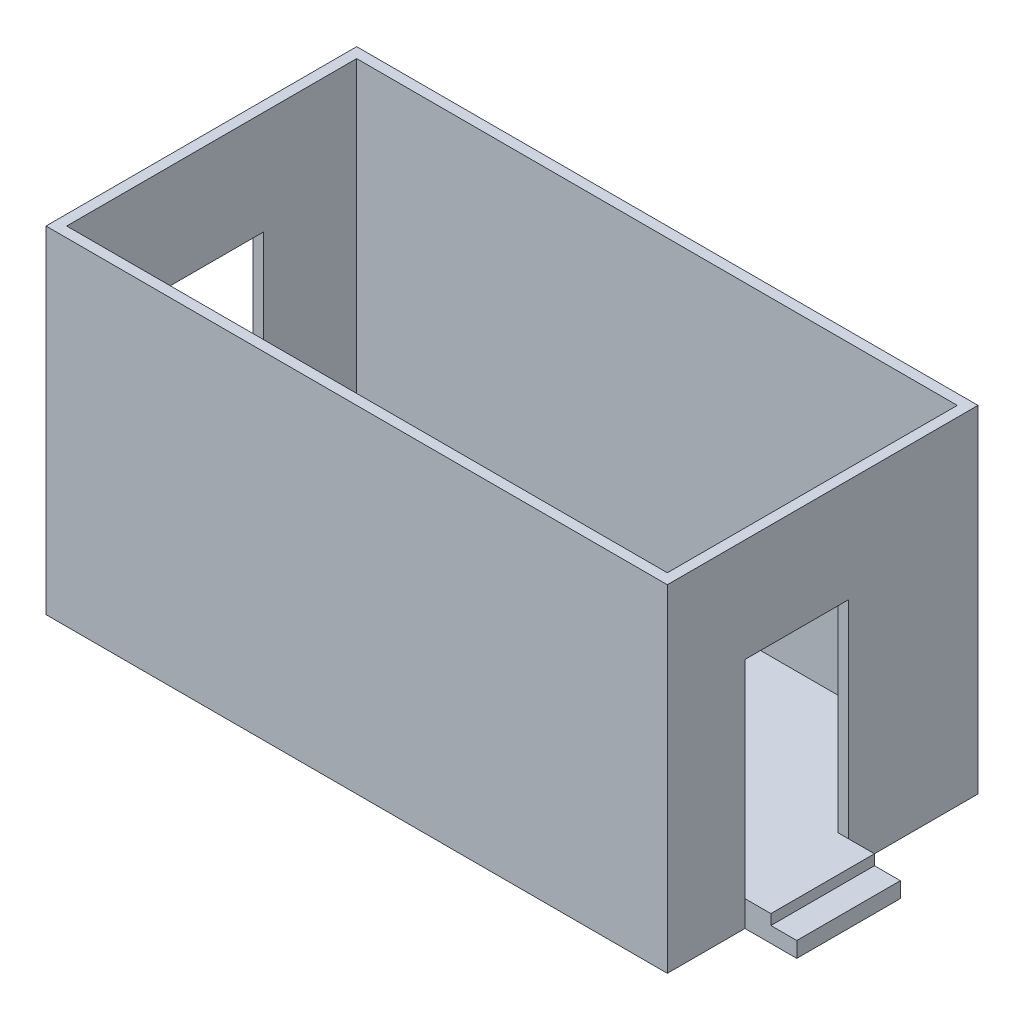
ISO-10303-21;
HEADER;
FILE_DESCRIPTION(('STEP AP214'),'2;1');
FILE_NAME('part.step','',(''),(''),'','','');
FILE_SCHEMA(('AUTOMOTIVE_DESIGN { 1 0 10303 214 1 1 1 1 }'));
ENDSEC;
DATA;
#1=APPLICATION_CONTEXT('core data for automotive mechanical design processes');
#2=APPLICATION_PROTOCOL_DEFINITION('international standard','automotive_design',2000,#1);
#3=PRODUCT_CONTEXT('',#1,'mechanical');
#4=PRODUCT('Part','Part','',(#3));
#5=PRODUCT_RELATED_PRODUCT_CATEGORY('part','',(#4));
#6=PRODUCT_DEFINITION_FORMATION('','',#4);
#7=PRODUCT_DEFINITION_CONTEXT('part definition',#1,'design');
#8=PRODUCT_DEFINITION('design','',#6,#7);
#9=PRODUCT_DEFINITION_SHAPE('','',#8);
#10=(LENGTH_UNIT() NAMED_UNIT(*) SI_UNIT(.MILLI.,.METRE.));
#11=(NAMED_UNIT(*) PLANE_ANGLE_UNIT() SI_UNIT($,.RADIAN.));
#12=(NAMED_UNIT(*) SI_UNIT($,.STERADIAN.) SOLID_ANGLE_UNIT());
#13=UNCERTAINTY_MEASURE_WITH_UNIT(LENGTH_MEASURE(1.E-05),#10,'distance_accuracy_value','');
#14=(GEOMETRIC_REPRESENTATION_CONTEXT(3) GLOBAL_UNCERTAINTY_ASSIGNED_CONTEXT((#13)) GLOBAL_UNIT_ASSIGNED_CONTEXT((#10,
#11,#12)) REPRESENTATION_CONTEXT('',''));
#15=CARTESIAN_POINT('',(0.,0.,0.));
#16=DIRECTION('',(0.,0.,1.));
#17=DIRECTION('',(1.,0.,0.));
#18=AXIS2_PLACEMENT_3D('',#15,#16,#17);
#19=CARTESIAN_POINT('',(-3500.,0.,0.));
#20=DIRECTION('',(-1.,0.,0.));
#21=DIRECTION('',(0.,0.,1.));
#22=AXIS2_PLACEMENT_3D('',#19,#20,#21);
#23=PLANE('',#22);
#24=DIRECTION('',(0.,1.,0.));
#25=VECTOR('',#24,1.);
#26=CARTESIAN_POINT('',(-3500.,250.,500.000000000001));
#27=LINE('',#26,#25);
#28=CARTESIAN_POINT('',(-3500.,0.,500.000000000001));
#29=VERTEX_POINT('',#28);
#30=CARTESIAN_POINT('',(-3500.,150.,500.000000000001));
#31=VERTEX_POINT('',#30);
#32=EDGE_CURVE('E224',#29,#31,#27,.T.);
#33=ORIENTED_EDGE('',*,*,#32,.T.);
#34=DIRECTION('',(0.,0.,1.));
#35=VECTOR('',#34,1.);
#36=CARTESIAN_POINT('',(-3500.,150.,-499.999999999999));
#37=LINE('',#36,#35);
#38=CARTESIAN_POINT('',(-3500.,150.,-499.999999999999));
#39=VERTEX_POINT('',#38);
#40=EDGE_CURVE('E209',#39,#31,#37,.T.);
#41=ORIENTED_EDGE('',*,*,#40,.F.);
#42=DIRECTION('',(0.,-1.,0.));
#43=VECTOR('',#42,1.);
#44=CARTESIAN_POINT('',(-3500.,250.,-499.999999999999));
#45=LINE('',#44,#43);
#46=CARTESIAN_POINT('',(-3500.,0.,-499.999999999999));
#47=VERTEX_POINT('',#46);
#48=EDGE_CURVE('E235',#39,#47,#45,.T.);
#49=ORIENTED_EDGE('',*,*,#48,.T.);
#50=DIRECTION('',(0.,0.,1.));
#51=VECTOR('',#50,1.);
#52=CARTESIAN_POINT('',(-3500.,0.,-499.999999999999));
#53=LINE('',#52,#51);
#54=EDGE_CURVE('E229',#47,#29,#53,.T.);
#55=ORIENTED_EDGE('',*,*,#54,.T.);
#56=EDGE_LOOP('',(#33,#41,#49,#55));
#57=FACE_BOUND('',#56,.T.);
#58=ADVANCED_FACE('F37',(#57),#23,.T.);
#59=CARTESIAN_POINT('',(-3000.,250.,-1500.));
#60=DIRECTION('',(1.,0.,0.));
#61=DIRECTION('',(0.,0.,-1.));
#62=AXIS2_PLACEMENT_3D('',#59,#60,#61);
#63=PLANE('',#62);
#64=DIRECTION('',(0.,-1.,0.));
#65=VECTOR('',#64,1.);
#66=CARTESIAN_POINT('',(-3000.,250.,-499.999999999999));
#67=LINE('',#66,#65);
#68=CARTESIAN_POINT('',(-3000.,250.,-499.999999999999));
#69=VERTEX_POINT('',#68);
#70=CARTESIAN_POINT('',(-3000.,0.,-499.999999999999));
#71=VERTEX_POINT('',#70);
#72=EDGE_CURVE('E239',#69,#71,#67,.T.);
#73=ORIENTED_EDGE('',*,*,#72,.F.);
#74=DIRECTION('',(0.,-1.,0.));
#75=VECTOR('',#74,1.);
#76=CARTESIAN_POINT('',(-3000.,2250.,-500.));
#77=LINE('',#76,#75);
#78=CARTESIAN_POINT('',(-3000.,2250.,-500.));
#79=VERTEX_POINT('',#78);
#80=EDGE_CURVE('E299',#79,#69,#77,.T.);
#81=ORIENTED_EDGE('',*,*,#80,.F.);
#82=DIRECTION('',(0.,0.,-1.));
#83=VECTOR('',#82,1.);
#84=CARTESIAN_POINT('',(-3000.,2250.,-500.));
#85=LINE('',#84,#83);
#86=CARTESIAN_POINT('',(-3000.,2250.,500.));
#87=VERTEX_POINT('',#86);
#88=EDGE_CURVE('E305',#87,#79,#85,.T.);
#89=ORIENTED_EDGE('',*,*,#88,.F.);
#90=DIRECTION('',(0.,1.,0.));
#91=VECTOR('',#90,1.);
#92=CARTESIAN_POINT('',(-3000.,2250.,500.));
#93=LINE('',#92,#91);
#94=CARTESIAN_POINT('',(-3000.,250.,500.000000000001));
#95=VERTEX_POINT('',#94);
#96=EDGE_CURVE('E302',#95,#87,#93,.T.);
#97=ORIENTED_EDGE('',*,*,#96,.F.);
#98=DIRECTION('',(0.,1.,0.));
#99=VECTOR('',#98,1.);
#100=CARTESIAN_POINT('',(-3000.,250.,500.000000000001));
#101=LINE('',#100,#99);
#102=CARTESIAN_POINT('',(-3000.,0.,500.));
#103=VERTEX_POINT('',#102);
#104=EDGE_CURVE('E242',#103,#95,#101,.T.);
#105=ORIENTED_EDGE('',*,*,#104,.F.);
#106=DIRECTION('',(0.,0.,1.));
#107=VECTOR('',#106,1.);
#108=CARTESIAN_POINT('',(-3000.,0.,-1500.));
#109=LINE('',#108,#107);
#110=CARTESIAN_POINT('',(-3000.,0.,1500.));
#111=VERTEX_POINT('',#110);
#112=EDGE_CURVE('E373',#103,#111,#109,.T.);
#113=ORIENTED_EDGE('',*,*,#112,.T.);
#114=DIRECTION('',(0.,-1.,0.));
#115=VECTOR('',#114,1.);
#116=CARTESIAN_POINT('',(-3000.,250.,1500.));
#117=LINE('',#116,#115);
#118=CARTESIAN_POINT('',(-3000.,3250.,1500.));
#119=VERTEX_POINT('',#118);
#120=EDGE_CURVE('E381',#119,#111,#117,.T.);
#121=ORIENTED_EDGE('',*,*,#120,.F.);
#122=DIRECTION('',(0.,0.,1.));
#123=VECTOR('',#122,1.);
#124=CARTESIAN_POINT('',(-3000.,3250.,-1500.));
#125=LINE('',#124,#123);
#126=CARTESIAN_POINT('',(-3000.,3250.,-1500.));
#127=VERTEX_POINT('',#126);
#128=EDGE_CURVE('E356',#127,#119,#125,.T.);
#129=ORIENTED_EDGE('',*,*,#128,.F.);
#130=DIRECTION('',(0.,-1.,0.));
#131=VECTOR('',#130,1.);
#132=CARTESIAN_POINT('',(-3000.,250.,-1500.));
#133=LINE('',#132,#131);
#134=CARTESIAN_POINT('',(-3000.,0.,-1500.));
#135=VERTEX_POINT('',#134);
#136=EDGE_CURVE('E384',#127,#135,#133,.T.);
#137=ORIENTED_EDGE('',*,*,#136,.T.);
#138=EDGE_CURVE('E374',#135,#71,#109,.T.);
#139=ORIENTED_EDGE('',*,*,#138,.T.);
#140=EDGE_LOOP('',(#73,#81,#89,#97,#105,#113,#121,#129,#137,#139));
#141=FACE_BOUND('',#140,.T.);
#142=ADVANCED_FACE('F453',(#141),#63,.F.);
#143=CARTESIAN_POINT('',(3000.,250.,-1500.));
#144=DIRECTION('',(-1.,0.,0.));
#145=DIRECTION('',(0.,0.,1.));
#146=AXIS2_PLACEMENT_3D('',#143,#144,#145);
#147=PLANE('',#146);
#148=DIRECTION('',(0.,-1.,0.));
#149=VECTOR('',#148,1.);
#150=CARTESIAN_POINT('',(3000.,250.,750.));
#151=LINE('',#150,#149);
#152=CARTESIAN_POINT('',(3000.,250.,750.));
#153=VERTEX_POINT('',#152);
#154=CARTESIAN_POINT('',(3000.,0.,750.));
#155=VERTEX_POINT('',#154);
#156=EDGE_CURVE('E252',#153,#155,#151,.T.);
#157=ORIENTED_EDGE('',*,*,#156,.F.);
#158=DIRECTION('',(0.,-1.,0.));
#159=VECTOR('',#158,1.);
#160=CARTESIAN_POINT('',(3000.,2250.,750.));
#161=LINE('',#160,#159);
#162=CARTESIAN_POINT('',(3000.,2250.,750.));
#163=VERTEX_POINT('',#162);
#164=EDGE_CURVE('E275',#163,#153,#161,.T.);
#165=ORIENTED_EDGE('',*,*,#164,.F.);
#166=DIRECTION('',(0.,0.,1.));
#167=VECTOR('',#166,1.);
#168=CARTESIAN_POINT('',(3000.,2250.,750.));
#169=LINE('',#168,#167);
#170=CARTESIAN_POINT('',(3000.,2250.,-250.));
#171=VERTEX_POINT('',#170);
#172=EDGE_CURVE('E281',#171,#163,#169,.T.);
#173=ORIENTED_EDGE('',*,*,#172,.F.);
#174=DIRECTION('',(0.,1.,0.));
#175=VECTOR('',#174,1.);
#176=CARTESIAN_POINT('',(3000.,2250.,-250.));
#177=LINE('',#176,#175);
#178=CARTESIAN_POINT('',(3000.,250.,-250.));
#179=VERTEX_POINT('',#178);
#180=EDGE_CURVE('E278',#179,#171,#177,.T.);
#181=ORIENTED_EDGE('',*,*,#180,.F.);
#182=DIRECTION('',(0.,1.,0.));
#183=VECTOR('',#182,1.);
#184=CARTESIAN_POINT('',(3000.,250.,-250.));
#185=LINE('',#184,#183);
#186=CARTESIAN_POINT('',(3000.,0.,-250.));
#187=VERTEX_POINT('',#186);
#188=EDGE_CURVE('E256',#187,#179,#185,.T.);
#189=ORIENTED_EDGE('',*,*,#188,.F.);
#190=DIRECTION('',(0.,0.,-1.));
#191=VECTOR('',#190,1.);
#192=CARTESIAN_POINT('',(3000.,0.,-1500.));
#193=LINE('',#192,#191);
#194=CARTESIAN_POINT('',(3000.,0.,-1500.));
#195=VERTEX_POINT('',#194);
#196=EDGE_CURVE('E368',#187,#195,#193,.T.);
#197=ORIENTED_EDGE('',*,*,#196,.T.);
#198=DIRECTION('',(0.,-1.,0.));
#199=VECTOR('',#198,1.);
#200=CARTESIAN_POINT('',(3000.,250.,-1500.));
#201=LINE('',#200,#199);
#202=CARTESIAN_POINT('',(3000.,3250.,-1500.));
#203=VERTEX_POINT('',#202);
#204=EDGE_CURVE('E387',#203,#195,#201,.T.);
#205=ORIENTED_EDGE('',*,*,#204,.F.);
#206=DIRECTION('',(0.,0.,-1.));
#207=VECTOR('',#206,1.);
#208=CARTESIAN_POINT('',(3000.,3250.,-1500.));
#209=LINE('',#208,#207);
#210=CARTESIAN_POINT('',(3000.,3250.,1500.));
#211=VERTEX_POINT('',#210);
#212=EDGE_CURVE('E362',#211,#203,#209,.T.);
#213=ORIENTED_EDGE('',*,*,#212,.F.);
#214=DIRECTION('',(0.,-1.,0.));
#215=VECTOR('',#214,1.);
#216=CARTESIAN_POINT('',(3000.,250.,1500.));
#217=LINE('',#216,#215);
#218=CARTESIAN_POINT('',(3000.,0.,1500.));
#219=VERTEX_POINT('',#218);
#220=EDGE_CURVE('E378',#211,#219,#217,.T.);
#221=ORIENTED_EDGE('',*,*,#220,.T.);
#222=EDGE_CURVE('E369',#219,#155,#193,.T.);
#223=ORIENTED_EDGE('',*,*,#222,.T.);
#224=EDGE_LOOP('',(#157,#165,#173,#181,#189,#197,#205,#213,#221,#223));
#225=FACE_BOUND('',#224,.T.);
#226=ADVANCED_FACE('F39',(#225),#147,.F.);
#227=CARTESIAN_POINT('',(-3000.,250.,-1500.));
#228=DIRECTION('',(0.,0.,1.));
#229=DIRECTION('',(1.,0.,0.));
#230=AXIS2_PLACEMENT_3D('',#227,#228,#229);
#231=PLANE('',#230);
#232=DIRECTION('',(-1.,0.,0.));
#233=VECTOR('',#232,1.);
#234=CARTESIAN_POINT('',(-3000.,0.,-1500.));
#235=LINE('',#234,#233);
#236=EDGE_CURVE('E371',#195,#135,#235,.T.);
#237=ORIENTED_EDGE('',*,*,#236,.T.);
#238=ORIENTED_EDGE('',*,*,#136,.F.);
#239=DIRECTION('',(-1.,0.,0.));
#240=VECTOR('',#239,1.);
#241=CARTESIAN_POINT('',(-3000.,3250.,-1500.));
#242=LINE('',#241,#240);
#243=EDGE_CURVE('E365',#203,#127,#242,.T.);
#244=ORIENTED_EDGE('',*,*,#243,.F.);
#245=ORIENTED_EDGE('',*,*,#204,.T.);
#246=EDGE_LOOP('',(#237,#238,#244,#245));
#247=FACE_BOUND('',#246,.T.);
#248=ADVANCED_FACE('F612',(#247),#231,.F.);
#249=CARTESIAN_POINT('',(-3000.,250.,1500.));
#250=DIRECTION('',(0.,0.,-1.));
#251=DIRECTION('',(-1.,0.,0.));
#252=AXIS2_PLACEMENT_3D('',#249,#250,#251);
#253=PLANE('',#252);
#254=DIRECTION('',(1.,0.,0.));
#255=VECTOR('',#254,1.);
#256=CARTESIAN_POINT('',(-3000.,0.,1500.));
#257=LINE('',#256,#255);
#258=EDGE_CURVE('E376',#111,#219,#257,.T.);
#259=ORIENTED_EDGE('',*,*,#258,.T.);
#260=ORIENTED_EDGE('',*,*,#220,.F.);
#261=DIRECTION('',(1.,0.,0.));
#262=VECTOR('',#261,1.);
#263=CARTESIAN_POINT('',(-3000.,3250.,1500.));
#264=LINE('',#263,#262);
#265=EDGE_CURVE('E359',#119,#211,#264,.T.);
#266=ORIENTED_EDGE('',*,*,#265,.F.);
#267=ORIENTED_EDGE('',*,*,#120,.T.);
#268=EDGE_LOOP('',(#259,#260,#266,#267));
#269=FACE_BOUND('',#268,.T.);
#270=ADVANCED_FACE('F586',(#269),#253,.F.);
#271=CARTESIAN_POINT('',(0.,0.,0.));
#272=DIRECTION('',(0.,1.,0.));
#273=DIRECTION('',(0.,0.,1.));
#274=AXIS2_PLACEMENT_3D('',#271,#272,#273);
#275=PLANE('',#274);
#276=ORIENTED_EDGE('',*,*,#222,.F.);
#277=ORIENTED_EDGE('',*,*,#258,.F.);
#278=ORIENTED_EDGE('',*,*,#112,.F.);
#279=DIRECTION('',(1.,0.,0.));
#280=VECTOR('',#279,1.);
#281=CARTESIAN_POINT('',(-3500.,0.,500.000000000001));
#282=LINE('',#281,#280);
#283=EDGE_CURVE('E247',#29,#103,#282,.T.);
#284=ORIENTED_EDGE('',*,*,#283,.F.);
#285=ORIENTED_EDGE('',*,*,#54,.F.);
#286=DIRECTION('',(1.,0.,0.));
#287=VECTOR('',#286,1.);
#288=CARTESIAN_POINT('',(-3500.,0.,-499.999999999999));
#289=LINE('',#288,#287);
#290=EDGE_CURVE('E249',#47,#71,#289,.T.);
#291=ORIENTED_EDGE('',*,*,#290,.T.);
#292=ORIENTED_EDGE('',*,*,#138,.F.);
#293=ORIENTED_EDGE('',*,*,#236,.F.);
#294=ORIENTED_EDGE('',*,*,#196,.F.);
#295=DIRECTION('',(-1.,0.,0.));
#296=VECTOR('',#295,1.);
#297=CARTESIAN_POINT('',(3500.,0.,-250.));
#298=LINE('',#297,#296);
#299=CARTESIAN_POINT('',(3500.,0.,-250.));
#300=VERTEX_POINT('',#299);
#301=EDGE_CURVE('E269',#300,#187,#298,.T.);
#302=ORIENTED_EDGE('',*,*,#301,.F.);
#303=DIRECTION('',(0.,0.,-1.));
#304=VECTOR('',#303,1.);
#305=CARTESIAN_POINT('',(3500.,0.,750.));
#306=LINE('',#305,#304);
#307=CARTESIAN_POINT('',(3500.,0.,750.));
#308=VERTEX_POINT('',#307);
#309=EDGE_CURVE('E255',#308,#300,#306,.T.);
#310=ORIENTED_EDGE('',*,*,#309,.F.);
#311=DIRECTION('',(-1.,0.,0.));
#312=VECTOR('',#311,1.);
#313=CARTESIAN_POINT('',(3500.,0.,750.));
#314=LINE('',#313,#312);
#315=EDGE_CURVE('E272',#308,#155,#314,.T.);
#316=ORIENTED_EDGE('',*,*,#315,.T.);
#317=EDGE_LOOP('',(#276,#277,#278,#284,#285,#291,#292,#293,#294,#302,#310,#316));
#318=FACE_BOUND('',#317,.T.);
#319=ADVANCED_FACE('F444',(#318),#275,.F.);
#320=CARTESIAN_POINT('',(0.,3250.,0.));
#321=DIRECTION('',(0.,1.,0.));
#322=DIRECTION('',(0.,0.,1.));
#323=AXIS2_PLACEMENT_3D('',#320,#321,#322);
#324=PLANE('',#323);
#325=ORIENTED_EDGE('',*,*,#128,.T.);
#326=ORIENTED_EDGE('',*,*,#265,.T.);
#327=ORIENTED_EDGE('',*,*,#212,.T.);
#328=ORIENTED_EDGE('',*,*,#243,.T.);
#329=EDGE_LOOP('',(#325,#326,#327,#328));
#330=FACE_BOUND('',#329,.T.);
#331=DIRECTION('',(1.,0.,0.));
#332=VECTOR('',#331,1.);
#333=CARTESIAN_POINT('',(-2900.,3250.,1400.));
#334=LINE('',#333,#332);
#335=CARTESIAN_POINT('',(-2900.,3250.,1400.));
#336=VERTEX_POINT('',#335);
#337=CARTESIAN_POINT('',(2900.,3250.,1400.));
#338=VERTEX_POINT('',#337);
#339=EDGE_CURVE('E326',#336,#338,#334,.T.);
#340=ORIENTED_EDGE('',*,*,#339,.F.);
#341=DIRECTION('',(0.,0.,1.));
#342=VECTOR('',#341,1.);
#343=CARTESIAN_POINT('',(-2900.,3250.,-1400.));
#344=LINE('',#343,#342);
#345=CARTESIAN_POINT('',(-2900.,3250.,-1400.));
#346=VERTEX_POINT('',#345);
#347=EDGE_CURVE('E324',#346,#336,#344,.T.);
#348=ORIENTED_EDGE('',*,*,#347,.F.);
#349=DIRECTION('',(-1.,0.,0.));
#350=VECTOR('',#349,1.);
#351=CARTESIAN_POINT('',(-2900.,3250.,-1400.));
#352=LINE('',#351,#350);
#353=CARTESIAN_POINT('',(2900.,3250.,-1400.));
#354=VERTEX_POINT('',#353);
#355=EDGE_CURVE('E332',#354,#346,#352,.T.);
#356=ORIENTED_EDGE('',*,*,#355,.F.);
#357=DIRECTION('',(0.,0.,-1.));
#358=VECTOR('',#357,1.);
#359=CARTESIAN_POINT('',(2900.,3250.,-1400.));
#360=LINE('',#359,#358);
#361=EDGE_CURVE('E329',#338,#354,#360,.T.);
#362=ORIENTED_EDGE('',*,*,#361,.F.);
#363=EDGE_LOOP('',(#340,#348,#356,#362));
#364=FACE_BOUND('',#363,.T.);
#365=ADVANCED_FACE('F464',(#330,#364),#324,.T.);
#366=CARTESIAN_POINT('',(-2900.,3250.,-1400.));
#367=DIRECTION('',(1.,0.,0.));
#368=DIRECTION('',(0.,0.,-1.));
#369=AXIS2_PLACEMENT_3D('',#366,#367,#368);
#370=PLANE('',#369);
#371=DIRECTION('',(0.,1.,0.));
#372=VECTOR('',#371,1.);
#373=CARTESIAN_POINT('',(-2900.,3250.,-500.));
#374=LINE('',#373,#372);
#375=CARTESIAN_POINT('',(-2900.,250.,-499.999999999999));
#376=VERTEX_POINT('',#375);
#377=CARTESIAN_POINT('',(-2900.,2250.,-500.));
#378=VERTEX_POINT('',#377);
#379=EDGE_CURVE('E321',#376,#378,#374,.T.);
#380=ORIENTED_EDGE('',*,*,#379,.F.);
#381=DIRECTION('',(0.,0.,1.));
#382=VECTOR('',#381,1.);
#383=CARTESIAN_POINT('',(-2900.,250.,-1400.));
#384=LINE('',#383,#382);
#385=CARTESIAN_POINT('',(-2900.,250.,-1400.));
#386=VERTEX_POINT('',#385);
#387=EDGE_CURVE('E335',#386,#376,#384,.T.);
#388=ORIENTED_EDGE('',*,*,#387,.F.);
#389=DIRECTION('',(0.,-1.,0.));
#390=VECTOR('',#389,1.);
#391=CARTESIAN_POINT('',(-2900.,3250.,-1400.));
#392=LINE('',#391,#390);
#393=EDGE_CURVE('E334',#346,#386,#392,.T.);
#394=ORIENTED_EDGE('',*,*,#393,.F.);
#395=ORIENTED_EDGE('',*,*,#347,.T.);
#396=DIRECTION('',(0.,-1.,0.));
#397=VECTOR('',#396,1.);
#398=CARTESIAN_POINT('',(-2900.,3250.,1400.));
#399=LINE('',#398,#397);
#400=CARTESIAN_POINT('',(-2900.,250.,1400.));
#401=VERTEX_POINT('',#400);
#402=EDGE_CURVE('E353',#336,#401,#399,.T.);
#403=ORIENTED_EDGE('',*,*,#402,.T.);
#404=CARTESIAN_POINT('',(-2900.,250.,500.000000000001));
#405=VERTEX_POINT('',#404);
#406=EDGE_CURVE('E323',#405,#401,#384,.T.);
#407=ORIENTED_EDGE('',*,*,#406,.F.);
#408=DIRECTION('',(0.,-1.,0.));
#409=VECTOR('',#408,1.);
#410=CARTESIAN_POINT('',(-2900.,3250.,500.));
#411=LINE('',#410,#409);
#412=CARTESIAN_POINT('',(-2900.,2250.,500.));
#413=VERTEX_POINT('',#412);
#414=EDGE_CURVE('E311',#413,#405,#411,.T.);
#415=ORIENTED_EDGE('',*,*,#414,.F.);
#416=DIRECTION('',(0.,0.,1.));
#417=VECTOR('',#416,1.);
#418=CARTESIAN_POINT('',(-2900.,2250.,-1400.));
#419=LINE('',#418,#417);
#420=EDGE_CURVE('E45',#378,#413,#419,.T.);
#421=ORIENTED_EDGE('',*,*,#420,.F.);
#422=EDGE_LOOP('',(#380,#388,#394,#395,#403,#407,#415,#421));
#423=FACE_BOUND('',#422,.T.);
#424=ADVANCED_FACE('F402',(#423),#370,.T.);
#425=CARTESIAN_POINT('',(-2900.,3250.,1400.));
#426=DIRECTION('',(0.,0.,-1.));
#427=DIRECTION('',(-1.,0.,0.));
#428=AXIS2_PLACEMENT_3D('',#425,#426,#427);
#429=PLANE('',#428);
#430=DIRECTION('',(1.,0.,0.));
#431=VECTOR('',#430,1.);
#432=CARTESIAN_POINT('',(-2900.,250.,1400.));
#433=LINE('',#432,#431);
#434=CARTESIAN_POINT('',(2900.,250.,1400.));
#435=VERTEX_POINT('',#434);
#436=EDGE_CURVE('E338',#401,#435,#433,.T.);
#437=ORIENTED_EDGE('',*,*,#436,.F.);
#438=ORIENTED_EDGE('',*,*,#402,.F.);
#439=ORIENTED_EDGE('',*,*,#339,.T.);
#440=DIRECTION('',(0.,-1.,0.));
#441=VECTOR('',#440,1.);
#442=CARTESIAN_POINT('',(2900.,3250.,1400.));
#443=LINE('',#442,#441);
#444=EDGE_CURVE('E350',#338,#435,#443,.T.);
#445=ORIENTED_EDGE('',*,*,#444,.T.);
#446=EDGE_LOOP('',(#437,#438,#439,#445));
#447=FACE_BOUND('',#446,.T.);
#448=ADVANCED_FACE('F409',(#447),#429,.T.);
#449=CARTESIAN_POINT('',(2900.,3250.,-1400.));
#450=DIRECTION('',(-1.,0.,0.));
#451=DIRECTION('',(0.,0.,1.));
#452=AXIS2_PLACEMENT_3D('',#449,#450,#451);
#453=PLANE('',#452);
#454=DIRECTION('',(0.,1.,0.));
#455=VECTOR('',#454,1.);
#456=CARTESIAN_POINT('',(2900.,3250.,750.));
#457=LINE('',#456,#455);
#458=CARTESIAN_POINT('',(2900.,250.,750.));
#459=VERTEX_POINT('',#458);
#460=CARTESIAN_POINT('',(2900.,2250.,750.));
#461=VERTEX_POINT('',#460);
#462=EDGE_CURVE('E297',#459,#461,#457,.T.);
#463=ORIENTED_EDGE('',*,*,#462,.F.);
#464=DIRECTION('',(0.,0.,-1.));
#465=VECTOR('',#464,1.);
#466=CARTESIAN_POINT('',(2900.,250.,-1400.));
#467=LINE('',#466,#465);
#468=EDGE_CURVE('E341',#435,#459,#467,.T.);
#469=ORIENTED_EDGE('',*,*,#468,.F.);
#470=ORIENTED_EDGE('',*,*,#444,.F.);
#471=ORIENTED_EDGE('',*,*,#361,.T.);
#472=DIRECTION('',(0.,-1.,0.));
#473=VECTOR('',#472,1.);
#474=CARTESIAN_POINT('',(2900.,3250.,-1400.));
#475=LINE('',#474,#473);
#476=CARTESIAN_POINT('',(2900.,250.,-1400.));
#477=VERTEX_POINT('',#476);
#478=EDGE_CURVE('E347',#354,#477,#475,.T.);
#479=ORIENTED_EDGE('',*,*,#478,.T.);
#480=CARTESIAN_POINT('',(2900.,250.,-250.));
#481=VERTEX_POINT('',#480);
#482=EDGE_CURVE('E340',#481,#477,#467,.T.);
#483=ORIENTED_EDGE('',*,*,#482,.F.);
#484=DIRECTION('',(0.,-1.,0.));
#485=VECTOR('',#484,1.);
#486=CARTESIAN_POINT('',(2900.,3250.,-249.999999999999));
#487=LINE('',#486,#485);
#488=CARTESIAN_POINT('',(2900.,2250.,-250.));
#489=VERTEX_POINT('',#488);
#490=EDGE_CURVE('E287',#489,#481,#487,.T.);
#491=ORIENTED_EDGE('',*,*,#490,.F.);
#492=DIRECTION('',(0.,0.,-1.));
#493=VECTOR('',#492,1.);
#494=CARTESIAN_POINT('',(2900.,2250.,-1400.));
#495=LINE('',#494,#493);
#496=EDGE_CURVE('E11',#461,#489,#495,.T.);
#497=ORIENTED_EDGE('',*,*,#496,.F.);
#498=EDGE_LOOP('',(#463,#469,#470,#471,#479,#483,#491,#497));
#499=FACE_BOUND('',#498,.T.);
#500=ADVANCED_FACE('F416',(#499),#453,.T.);
#501=CARTESIAN_POINT('',(-2900.,3250.,-1400.));
#502=DIRECTION('',(0.,0.,1.));
#503=DIRECTION('',(1.,0.,0.));
#504=AXIS2_PLACEMENT_3D('',#501,#502,#503);
#505=PLANE('',#504);
#506=DIRECTION('',(-1.,0.,0.));
#507=VECTOR('',#506,1.);
#508=CARTESIAN_POINT('',(-2900.,250.,-1400.));
#509=LINE('',#508,#507);
#510=EDGE_CURVE('E327',#477,#386,#509,.T.);
#511=ORIENTED_EDGE('',*,*,#510,.F.);
#512=ORIENTED_EDGE('',*,*,#478,.F.);
#513=ORIENTED_EDGE('',*,*,#355,.T.);
#514=ORIENTED_EDGE('',*,*,#393,.T.);
#515=EDGE_LOOP('',(#511,#512,#513,#514));
#516=FACE_BOUND('',#515,.T.);
#517=ADVANCED_FACE('F461',(#516),#505,.T.);
#518=CARTESIAN_POINT('',(0.,250.,0.));
#519=DIRECTION('',(0.,1.,0.));
#520=DIRECTION('',(0.,0.,1.));
#521=AXIS2_PLACEMENT_3D('',#518,#519,#520);
#522=PLANE('',#521);
#523=DIRECTION('',(0.,0.,-1.));
#524=VECTOR('',#523,1.);
#525=CARTESIAN_POINT('',(-3250.,250.,-499.999999999999));
#526=LINE('',#525,#524);
#527=CARTESIAN_POINT('',(-3250.,250.,500.000000000001));
#528=VERTEX_POINT('',#527);
#529=CARTESIAN_POINT('',(-3250.,250.,-499.999999999999));
#530=VERTEX_POINT('',#529);
#531=EDGE_CURVE('E217',#528,#530,#526,.T.);
#532=ORIENTED_EDGE('',*,*,#531,.F.);
#533=DIRECTION('',(1.,0.,0.));
#534=VECTOR('',#533,1.);
#535=CARTESIAN_POINT('',(-3500.,250.,500.000000000001));
#536=LINE('',#535,#534);
#537=EDGE_CURVE('E233',#528,#95,#536,.T.);
#538=ORIENTED_EDGE('',*,*,#537,.T.);
#539=DIRECTION('',(-1.,0.,0.));
#540=VECTOR('',#539,1.);
#541=CARTESIAN_POINT('',(-2750.,250.,500.000000000001));
#542=LINE('',#541,#540);
#543=EDGE_CURVE('E314',#405,#95,#542,.T.);
#544=ORIENTED_EDGE('',*,*,#543,.F.);
#545=ORIENTED_EDGE('',*,*,#406,.T.);
#546=ORIENTED_EDGE('',*,*,#436,.T.);
#547=ORIENTED_EDGE('',*,*,#468,.T.);
#548=DIRECTION('',(1.,0.,0.));
#549=VECTOR('',#548,1.);
#550=CARTESIAN_POINT('',(2750.,250.,750.));
#551=LINE('',#550,#549);
#552=EDGE_CURVE('E284',#459,#153,#551,.T.);
#553=ORIENTED_EDGE('',*,*,#552,.T.);
#554=DIRECTION('',(-1.,0.,0.));
#555=VECTOR('',#554,1.);
#556=CARTESIAN_POINT('',(3500.,250.,750.));
#557=LINE('',#556,#555);
#558=CARTESIAN_POINT('',(3250.,250.,750.));
#559=VERTEX_POINT('',#558);
#560=EDGE_CURVE('E261',#559,#153,#557,.T.);
#561=ORIENTED_EDGE('',*,*,#560,.F.);
#562=DIRECTION('',(0.,0.,1.));
#563=VECTOR('',#562,1.);
#564=CARTESIAN_POINT('',(3250.,250.,-250.));
#565=LINE('',#564,#563);
#566=CARTESIAN_POINT('',(3250.,250.,-250.));
#567=VERTEX_POINT('',#566);
#568=EDGE_CURVE('E439',#567,#559,#565,.T.);
#569=ORIENTED_EDGE('',*,*,#568,.F.);
#570=DIRECTION('',(-1.,0.,0.));
#571=VECTOR('',#570,1.);
#572=CARTESIAN_POINT('',(3500.,250.,-250.));
#573=LINE('',#572,#571);
#574=EDGE_CURVE('E267',#567,#179,#573,.T.);
#575=ORIENTED_EDGE('',*,*,#574,.T.);
#576=DIRECTION('',(1.,0.,0.));
#577=VECTOR('',#576,1.);
#578=CARTESIAN_POINT('',(2750.,250.,-250.));
#579=LINE('',#578,#577);
#580=EDGE_CURVE('E290',#481,#179,#579,.T.);
#581=ORIENTED_EDGE('',*,*,#580,.F.);
#582=ORIENTED_EDGE('',*,*,#482,.T.);
#583=ORIENTED_EDGE('',*,*,#510,.T.);
#584=ORIENTED_EDGE('',*,*,#387,.T.);
#585=DIRECTION('',(-1.,0.,0.));
#586=VECTOR('',#585,1.);
#587=CARTESIAN_POINT('',(-2750.,250.,-499.999999999999));
#588=LINE('',#587,#586);
#589=EDGE_CURVE('E308',#376,#69,#588,.T.);
#590=ORIENTED_EDGE('',*,*,#589,.T.);
#591=DIRECTION('',(1.,0.,0.));
#592=VECTOR('',#591,1.);
#593=CARTESIAN_POINT('',(-3500.,250.,-499.999999999999));
#594=LINE('',#593,#592);
#595=EDGE_CURVE('E231',#530,#69,#594,.T.);
#596=ORIENTED_EDGE('',*,*,#595,.F.);
#597=EDGE_LOOP('',(#532,#538,#544,#545,#546,#547,#553,#561,#569,#575,#581,#582,#583,#584,#590,#596));
#598=FACE_BOUND('',#597,.T.);
#599=ADVANCED_FACE('F407',(#598),#522,.T.);
#600=CARTESIAN_POINT('',(-2750.,2250.,-500.));
#601=DIRECTION('',(0.,0.,-1.));
#602=DIRECTION('',(0.,1.,0.));
#603=AXIS2_PLACEMENT_3D('',#600,#601,#602);
#604=PLANE('',#603);
#605=ORIENTED_EDGE('',*,*,#379,.T.);
#606=DIRECTION('',(-1.,0.,0.));
#607=VECTOR('',#606,1.);
#608=CARTESIAN_POINT('',(-2750.,2250.,-500.));
#609=LINE('',#608,#607);
#610=EDGE_CURVE('E309',#378,#79,#609,.T.);
#611=ORIENTED_EDGE('',*,*,#610,.T.);
#612=ORIENTED_EDGE('',*,*,#80,.T.);
#613=ORIENTED_EDGE('',*,*,#589,.F.);
#614=EDGE_LOOP('',(#605,#611,#612,#613));
#615=FACE_BOUND('',#614,.T.);
#616=ADVANCED_FACE('F455',(#615),#604,.F.);
#617=CARTESIAN_POINT('',(-2750.,2250.,-500.));
#618=DIRECTION('',(0.,1.,0.));
#619=DIRECTION('',(0.,0.,1.));
#620=AXIS2_PLACEMENT_3D('',#617,#618,#619);
#621=PLANE('',#620);
#622=ORIENTED_EDGE('',*,*,#420,.T.);
#623=DIRECTION('',(-1.,0.,0.));
#624=VECTOR('',#623,1.);
#625=CARTESIAN_POINT('',(-2750.,2250.,500.));
#626=LINE('',#625,#624);
#627=EDGE_CURVE('E312',#413,#87,#626,.T.);
#628=ORIENTED_EDGE('',*,*,#627,.T.);
#629=ORIENTED_EDGE('',*,*,#88,.T.);
#630=ORIENTED_EDGE('',*,*,#610,.F.);
#631=EDGE_LOOP('',(#622,#628,#629,#630));
#632=FACE_BOUND('',#631,.T.);
#633=ADVANCED_FACE('F393',(#632),#621,.F.);
#634=CARTESIAN_POINT('',(-2750.,2250.,500.));
#635=DIRECTION('',(0.,0.,1.));
#636=DIRECTION('',(0.,-1.,0.));
#637=AXIS2_PLACEMENT_3D('',#634,#635,#636);
#638=PLANE('',#637);
#639=ORIENTED_EDGE('',*,*,#414,.T.);
#640=ORIENTED_EDGE('',*,*,#543,.T.);
#641=ORIENTED_EDGE('',*,*,#96,.T.);
#642=ORIENTED_EDGE('',*,*,#627,.F.);
#643=EDGE_LOOP('',(#639,#640,#641,#642));
#644=FACE_BOUND('',#643,.T.);
#645=ADVANCED_FACE('F398',(#644),#638,.F.);
#646=CARTESIAN_POINT('',(2750.,2250.,750.));
#647=DIRECTION('',(0.,0.,1.));
#648=DIRECTION('',(1.,0.,0.));
#649=AXIS2_PLACEMENT_3D('',#646,#647,#648);
#650=PLANE('',#649);
#651=ORIENTED_EDGE('',*,*,#462,.T.);
#652=DIRECTION('',(1.,0.,0.));
#653=VECTOR('',#652,1.);
#654=CARTESIAN_POINT('',(2750.,2250.,750.));
#655=LINE('',#654,#653);
#656=EDGE_CURVE('E285',#461,#163,#655,.T.);
#657=ORIENTED_EDGE('',*,*,#656,.T.);
#658=ORIENTED_EDGE('',*,*,#164,.T.);
#659=ORIENTED_EDGE('',*,*,#552,.F.);
#660=EDGE_LOOP('',(#651,#657,#658,#659));
#661=FACE_BOUND('',#660,.T.);
#662=ADVANCED_FACE('F421',(#661),#650,.F.);
#663=CARTESIAN_POINT('',(2750.,2250.,750.));
#664=DIRECTION('',(0.,1.,0.));
#665=DIRECTION('',(0.,0.,1.));
#666=AXIS2_PLACEMENT_3D('',#663,#664,#665);
#667=PLANE('',#666);
#668=ORIENTED_EDGE('',*,*,#496,.T.);
#669=DIRECTION('',(1.,0.,0.));
#670=VECTOR('',#669,1.);
#671=CARTESIAN_POINT('',(2750.,2250.,-250.));
#672=LINE('',#671,#670);
#673=EDGE_CURVE('E288',#489,#171,#672,.T.);
#674=ORIENTED_EDGE('',*,*,#673,.T.);
#675=ORIENTED_EDGE('',*,*,#172,.T.);
#676=ORIENTED_EDGE('',*,*,#656,.F.);
#677=EDGE_LOOP('',(#668,#674,#675,#676));
#678=FACE_BOUND('',#677,.T.);
#679=ADVANCED_FACE('F472',(#678),#667,.F.);
#680=CARTESIAN_POINT('',(2750.,2250.,-250.));
#681=DIRECTION('',(0.,0.,-1.));
#682=DIRECTION('',(-1.,0.,0.));
#683=AXIS2_PLACEMENT_3D('',#680,#681,#682);
#684=PLANE('',#683);
#685=ORIENTED_EDGE('',*,*,#490,.T.);
#686=ORIENTED_EDGE('',*,*,#580,.T.);
#687=ORIENTED_EDGE('',*,*,#180,.T.);
#688=ORIENTED_EDGE('',*,*,#673,.F.);
#689=EDGE_LOOP('',(#685,#686,#687,#688));
#690=FACE_BOUND('',#689,.T.);
#691=ADVANCED_FACE('F470',(#690),#684,.F.);
#692=CARTESIAN_POINT('',(3500.,250.,750.));
#693=DIRECTION('',(0.,0.,-1.));
#694=DIRECTION('',(-1.,0.,0.));
#695=AXIS2_PLACEMENT_3D('',#692,#693,#694);
#696=PLANE('',#695);
#697=DIRECTION('',(1.,0.,0.));
#698=VECTOR('',#697,1.);
#699=CARTESIAN_POINT('',(3500.,150.,750.));
#700=LINE('',#699,#698);
#701=CARTESIAN_POINT('',(3250.,150.,750.));
#702=VERTEX_POINT('',#701);
#703=CARTESIAN_POINT('',(3500.,150.,750.));
#704=VERTEX_POINT('',#703);
#705=EDGE_CURVE('E60',#702,#704,#700,.T.);
#706=ORIENTED_EDGE('',*,*,#705,.F.);
#707=DIRECTION('',(0.,1.,0.));
#708=VECTOR('',#707,1.);
#709=CARTESIAN_POINT('',(3250.,150.,750.));
#710=LINE('',#709,#708);
#711=EDGE_CURVE('E243',#702,#559,#710,.T.);
#712=ORIENTED_EDGE('',*,*,#711,.T.);
#713=ORIENTED_EDGE('',*,*,#560,.T.);
#714=ORIENTED_EDGE('',*,*,#156,.T.);
#715=ORIENTED_EDGE('',*,*,#315,.F.);
#716=DIRECTION('',(0.,-1.,0.));
#717=VECTOR('',#716,1.);
#718=CARTESIAN_POINT('',(3500.,250.,750.));
#719=LINE('',#718,#717);
#720=EDGE_CURVE('E253',#704,#308,#719,.T.);
#721=ORIENTED_EDGE('',*,*,#720,.F.);
#722=EDGE_LOOP('',(#706,#712,#713,#714,#715,#721));
#723=FACE_BOUND('',#722,.T.);
#724=ADVANCED_FACE('F431',(#723),#696,.F.);
#725=CARTESIAN_POINT('',(3500.,250.,-250.));
#726=DIRECTION('',(0.,0.,1.));
#727=DIRECTION('',(1.,0.,0.));
#728=AXIS2_PLACEMENT_3D('',#725,#726,#727);
#729=PLANE('',#728);
#730=ORIENTED_EDGE('',*,*,#574,.F.);
#731=DIRECTION('',(0.,1.,0.));
#732=VECTOR('',#731,1.);
#733=CARTESIAN_POINT('',(3250.,150.,-250.));
#734=LINE('',#733,#732);
#735=CARTESIAN_POINT('',(3250.,150.,-250.));
#736=VERTEX_POINT('',#735);
#737=EDGE_CURVE('E435',#736,#567,#734,.T.);
#738=ORIENTED_EDGE('',*,*,#737,.F.);
#739=DIRECTION('',(-1.,0.,0.));
#740=VECTOR('',#739,1.);
#741=CARTESIAN_POINT('',(3500.,150.,-250.));
#742=LINE('',#741,#740);
#743=CARTESIAN_POINT('',(3500.,150.,-250.));
#744=VERTEX_POINT('',#743);
#745=EDGE_CURVE('E733',#744,#736,#742,.T.);
#746=ORIENTED_EDGE('',*,*,#745,.F.);
#747=DIRECTION('',(0.,1.,0.));
#748=VECTOR('',#747,1.);
#749=CARTESIAN_POINT('',(3500.,250.,-250.));
#750=LINE('',#749,#748);
#751=EDGE_CURVE('E258',#300,#744,#750,.T.);
#752=ORIENTED_EDGE('',*,*,#751,.F.);
#753=ORIENTED_EDGE('',*,*,#301,.T.);
#754=ORIENTED_EDGE('',*,*,#188,.T.);
#755=EDGE_LOOP('',(#730,#738,#746,#752,#753,#754));
#756=FACE_BOUND('',#755,.T.);
#757=ADVANCED_FACE('F499',(#756),#729,.F.);
#758=CARTESIAN_POINT('',(3500.,0.,0.));
#759=DIRECTION('',(1.,0.,0.));
#760=DIRECTION('',(0.,0.,-1.));
#761=AXIS2_PLACEMENT_3D('',#758,#759,#760);
#762=PLANE('',#761);
#763=DIRECTION('',(0.,0.,-1.));
#764=VECTOR('',#763,1.);
#765=CARTESIAN_POINT('',(3500.,150.,-250.));
#766=LINE('',#765,#764);
#767=EDGE_CURVE('E734',#704,#744,#766,.T.);
#768=ORIENTED_EDGE('',*,*,#767,.F.);
#769=ORIENTED_EDGE('',*,*,#720,.T.);
#770=ORIENTED_EDGE('',*,*,#309,.T.);
#771=ORIENTED_EDGE('',*,*,#751,.T.);
#772=EDGE_LOOP('',(#768,#769,#770,#771));
#773=FACE_BOUND('',#772,.T.);
#774=ADVANCED_FACE('F496',(#773),#762,.T.);
#775=CARTESIAN_POINT('',(-3500.,250.,-499.999999999999));
#776=DIRECTION('',(0.,0.,1.));
#777=DIRECTION('',(1.,0.,0.));
#778=AXIS2_PLACEMENT_3D('',#775,#776,#777);
#779=PLANE('',#778);
#780=DIRECTION('',(-1.,0.,0.));
#781=VECTOR('',#780,1.);
#782=CARTESIAN_POINT('',(-3500.,150.,-499.999999999999));
#783=LINE('',#782,#781);
#784=CARTESIAN_POINT('',(-3250.,150.,-499.999999999999));
#785=VERTEX_POINT('',#784);
#786=EDGE_CURVE('E52',#785,#39,#783,.T.);
#787=ORIENTED_EDGE('',*,*,#786,.F.);
#788=DIRECTION('',(0.,1.,0.));
#789=VECTOR('',#788,1.);
#790=CARTESIAN_POINT('',(-3250.,150.,-499.999999999999));
#791=LINE('',#790,#789);
#792=EDGE_CURVE('E740',#785,#530,#791,.T.);
#793=ORIENTED_EDGE('',*,*,#792,.T.);
#794=ORIENTED_EDGE('',*,*,#595,.T.);
#795=ORIENTED_EDGE('',*,*,#72,.T.);
#796=ORIENTED_EDGE('',*,*,#290,.F.);
#797=ORIENTED_EDGE('',*,*,#48,.F.);
#798=EDGE_LOOP('',(#787,#793,#794,#795,#796,#797));
#799=FACE_BOUND('',#798,.T.);
#800=ADVANCED_FACE('F447',(#799),#779,.F.);
#801=CARTESIAN_POINT('',(-3500.,250.,500.000000000001));
#802=DIRECTION('',(0.,0.,-1.));
#803=DIRECTION('',(-1.,0.,0.));
#804=AXIS2_PLACEMENT_3D('',#801,#802,#803);
#805=PLANE('',#804);
#806=ORIENTED_EDGE('',*,*,#537,.F.);
#807=DIRECTION('',(0.,1.,0.));
#808=VECTOR('',#807,1.);
#809=CARTESIAN_POINT('',(-3250.,150.,500.000000000001));
#810=LINE('',#809,#808);
#811=CARTESIAN_POINT('',(-3250.,150.,500.000000000001));
#812=VERTEX_POINT('',#811);
#813=EDGE_CURVE('E225',#812,#528,#810,.T.);
#814=ORIENTED_EDGE('',*,*,#813,.F.);
#815=DIRECTION('',(1.,0.,0.));
#816=VECTOR('',#815,1.);
#817=CARTESIAN_POINT('',(-3500.,150.,500.000000000001));
#818=LINE('',#817,#816);
#819=EDGE_CURVE('E212',#31,#812,#818,.T.);
#820=ORIENTED_EDGE('',*,*,#819,.F.);
#821=ORIENTED_EDGE('',*,*,#32,.F.);
#822=ORIENTED_EDGE('',*,*,#283,.T.);
#823=ORIENTED_EDGE('',*,*,#104,.T.);
#824=EDGE_LOOP('',(#806,#814,#820,#821,#822,#823));
#825=FACE_BOUND('',#824,.T.);
#826=ADVANCED_FACE('F222',(#825),#805,.F.);
#827=CARTESIAN_POINT('',(3250.,150.,-250.));
#828=DIRECTION('',(-1.,0.,0.));
#829=DIRECTION('',(0.,0.,1.));
#830=AXIS2_PLACEMENT_3D('',#827,#828,#829);
#831=PLANE('',#830);
#832=ORIENTED_EDGE('',*,*,#568,.T.);
#833=ORIENTED_EDGE('',*,*,#711,.F.);
#834=DIRECTION('',(0.,0.,1.));
#835=VECTOR('',#834,1.);
#836=CARTESIAN_POINT('',(3250.,150.,-250.));
#837=LINE('',#836,#835);
#838=EDGE_CURVE('E745',#736,#702,#837,.T.);
#839=ORIENTED_EDGE('',*,*,#838,.F.);
#840=ORIENTED_EDGE('',*,*,#737,.T.);
#841=EDGE_LOOP('',(#832,#833,#839,#840));
#842=FACE_BOUND('',#841,.T.);
#843=ADVANCED_FACE('F490',(#842),#831,.F.);
#844=CARTESIAN_POINT('',(0.,150.,0.));
#845=DIRECTION('',(0.,-1.,0.));
#846=DIRECTION('',(0.,0.,-1.));
#847=AXIS2_PLACEMENT_3D('',#844,#845,#846);
#848=PLANE('',#847);
#849=ORIENTED_EDGE('',*,*,#767,.T.);
#850=ORIENTED_EDGE('',*,*,#745,.T.);
#851=ORIENTED_EDGE('',*,*,#838,.T.);
#852=ORIENTED_EDGE('',*,*,#705,.T.);
#853=EDGE_LOOP('',(#849,#850,#851,#852));
#854=FACE_BOUND('',#853,.T.);
#855=ADVANCED_FACE('F533',(#854),#848,.F.);
#856=CARTESIAN_POINT('',(-3250.,150.,-499.999999999999));
#857=DIRECTION('',(1.,0.,0.));
#858=DIRECTION('',(0.,0.,-1.));
#859=AXIS2_PLACEMENT_3D('',#856,#857,#858);
#860=PLANE('',#859);
#861=ORIENTED_EDGE('',*,*,#531,.T.);
#862=ORIENTED_EDGE('',*,*,#792,.F.);
#863=DIRECTION('',(0.,0.,-1.));
#864=VECTOR('',#863,1.);
#865=CARTESIAN_POINT('',(-3250.,150.,-499.999999999999));
#866=LINE('',#865,#864);
#867=EDGE_CURVE('E226',#812,#785,#866,.T.);
#868=ORIENTED_EDGE('',*,*,#867,.F.);
#869=ORIENTED_EDGE('',*,*,#813,.T.);
#870=EDGE_LOOP('',(#861,#862,#868,#869));
#871=FACE_BOUND('',#870,.T.);
#872=ADVANCED_FACE('F539',(#871),#860,.F.);
#873=CARTESIAN_POINT('',(0.,150.,0.));
#874=DIRECTION('',(0.,1.,0.));
#875=DIRECTION('',(0.,0.,1.));
#876=AXIS2_PLACEMENT_3D('',#873,#874,#875);
#877=PLANE('',#876);
#878=ORIENTED_EDGE('',*,*,#40,.T.);
#879=ORIENTED_EDGE('',*,*,#819,.T.);
#880=ORIENTED_EDGE('',*,*,#867,.T.);
#881=ORIENTED_EDGE('',*,*,#786,.T.);
#882=EDGE_LOOP('',(#878,#879,#880,#881));
#883=FACE_BOUND('',#882,.T.);
#884=ADVANCED_FACE('F211',(#883),#877,.T.);
#885=CLOSED_SHELL('',(#58,#142,#226,#248,#270,#319,#365,#424,#448,#500,#517,#599,#616,#633,#645,
#662,#679,#691,#724,#757,#774,#800,#826,#843,#855,#872,#884));
#886=MANIFOLD_SOLID_BREP('B2',#885);
#887=ADVANCED_BREP_SHAPE_REPRESENTATION('',(#18,#886),#14);
#888=SHAPE_DEFINITION_REPRESENTATION(#9,#887);
ENDSEC;
END-ISO-10303-21;
